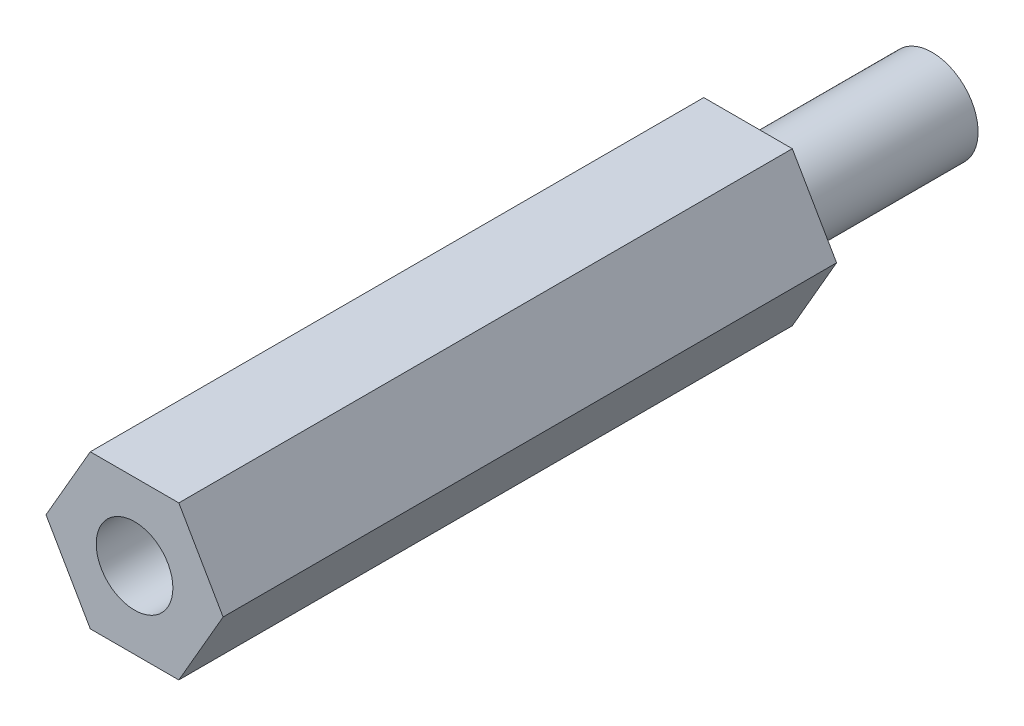
ISO-10303-21;
HEADER;
FILE_DESCRIPTION(('STEP AP214'),'2;1');
FILE_NAME('part.step','',(''),(''),'','','');
FILE_SCHEMA(('AUTOMOTIVE_DESIGN { 1 0 10303 214 1 1 1 1 }'));
ENDSEC;
DATA;
#1=APPLICATION_CONTEXT('core data for automotive mechanical design processes');
#2=APPLICATION_PROTOCOL_DEFINITION('international standard','automotive_design',2000,#1);
#3=PRODUCT_CONTEXT('',#1,'mechanical');
#4=PRODUCT('Part','Part','',(#3));
#5=PRODUCT_RELATED_PRODUCT_CATEGORY('part','',(#4));
#6=PRODUCT_DEFINITION_FORMATION('','',#4);
#7=PRODUCT_DEFINITION_CONTEXT('part definition',#1,'design');
#8=PRODUCT_DEFINITION('design','',#6,#7);
#9=PRODUCT_DEFINITION_SHAPE('','',#8);
#10=(LENGTH_UNIT() NAMED_UNIT(*) SI_UNIT(.MILLI.,.METRE.));
#11=(NAMED_UNIT(*) PLANE_ANGLE_UNIT() SI_UNIT($,.RADIAN.));
#12=(NAMED_UNIT(*) SI_UNIT($,.STERADIAN.) SOLID_ANGLE_UNIT());
#13=UNCERTAINTY_MEASURE_WITH_UNIT(LENGTH_MEASURE(1.E-05),#10,'distance_accuracy_value','');
#14=(GEOMETRIC_REPRESENTATION_CONTEXT(3) GLOBAL_UNCERTAINTY_ASSIGNED_CONTEXT((#13)) GLOBAL_UNIT_ASSIGNED_CONTEXT((#10,
#11,#12)) REPRESENTATION_CONTEXT('',''));
#15=CARTESIAN_POINT('',(0.,0.,0.));
#16=DIRECTION('',(0.,0.,1.));
#17=DIRECTION('',(1.,0.,0.));
#18=AXIS2_PLACEMENT_3D('',#15,#16,#17);
#19=CARTESIAN_POINT('',(1.44337567297406,2.5,20.));
#20=DIRECTION('',(0.,-1.,0.));
#21=DIRECTION('',(1.,0.,0.));
#22=AXIS2_PLACEMENT_3D('',#19,#20,#21);
#23=PLANE('',#22);
#24=DIRECTION('',(-1.,0.,0.));
#25=VECTOR('',#24,1.);
#26=CARTESIAN_POINT('',(1.44337567297406,2.5,0.));
#27=LINE('',#26,#25);
#28=CARTESIAN_POINT('',(1.44337567297406,2.5,0.));
#29=VERTEX_POINT('',#28);
#30=CARTESIAN_POINT('',(-1.44337567297407,2.5,0.));
#31=VERTEX_POINT('',#30);
#32=EDGE_CURVE('E123',#29,#31,#27,.T.);
#33=ORIENTED_EDGE('',*,*,#32,.T.);
#34=DIRECTION('',(0.,0.,-1.));
#35=VECTOR('',#34,1.);
#36=CARTESIAN_POINT('',(-1.44337567297407,2.5,20.));
#37=LINE('',#36,#35);
#38=CARTESIAN_POINT('',(-1.44337567297407,2.5,20.));
#39=VERTEX_POINT('',#38);
#40=EDGE_CURVE('E38',#39,#31,#37,.T.);
#41=ORIENTED_EDGE('',*,*,#40,.F.);
#42=DIRECTION('',(-1.,0.,0.));
#43=VECTOR('',#42,1.);
#44=CARTESIAN_POINT('',(1.44337567297406,2.5,20.));
#45=LINE('',#44,#43);
#46=CARTESIAN_POINT('',(1.44337567297406,2.5,20.));
#47=VERTEX_POINT('',#46);
#48=EDGE_CURVE('E134',#47,#39,#45,.T.);
#49=ORIENTED_EDGE('',*,*,#48,.F.);
#50=DIRECTION('',(0.,0.,-1.));
#51=VECTOR('',#50,1.);
#52=CARTESIAN_POINT('',(1.44337567297406,2.5,20.));
#53=LINE('',#52,#51);
#54=EDGE_CURVE('E119',#47,#29,#53,.T.);
#55=ORIENTED_EDGE('',*,*,#54,.T.);
#56=EDGE_LOOP('',(#33,#41,#49,#55));
#57=FACE_BOUND('',#56,.T.);
#58=ADVANCED_FACE('F35',(#57),#23,.F.);
#59=CARTESIAN_POINT('',(-1.44337567297407,2.5,20.));
#60=DIRECTION('',(0.866025403784439,-0.5,0.));
#61=DIRECTION('',(0.5,0.866025403784439,0.));
#62=AXIS2_PLACEMENT_3D('',#59,#60,#61);
#63=PLANE('',#62);
#64=DIRECTION('',(-0.5,-0.866025403784439,0.));
#65=VECTOR('',#64,1.);
#66=CARTESIAN_POINT('',(-1.44337567297407,2.5,0.));
#67=LINE('',#66,#65);
#68=CARTESIAN_POINT('',(-2.88675134594813,0.,0.));
#69=VERTEX_POINT('',#68);
#70=EDGE_CURVE('E126',#31,#69,#67,.T.);
#71=ORIENTED_EDGE('',*,*,#70,.T.);
#72=DIRECTION('',(0.,0.,-1.));
#73=VECTOR('',#72,1.);
#74=CARTESIAN_POINT('',(-2.88675134594813,0.,20.));
#75=LINE('',#74,#73);
#76=CARTESIAN_POINT('',(-2.88675134594813,0.,20.));
#77=VERTEX_POINT('',#76);
#78=EDGE_CURVE('E137',#77,#69,#75,.T.);
#79=ORIENTED_EDGE('',*,*,#78,.F.);
#80=DIRECTION('',(-0.5,-0.866025403784439,0.));
#81=VECTOR('',#80,1.);
#82=CARTESIAN_POINT('',(-1.44337567297407,2.5,20.));
#83=LINE('',#82,#81);
#84=EDGE_CURVE('E91',#39,#77,#83,.T.);
#85=ORIENTED_EDGE('',*,*,#84,.F.);
#86=ORIENTED_EDGE('',*,*,#40,.T.);
#87=EDGE_LOOP('',(#71,#79,#85,#86));
#88=FACE_BOUND('',#87,.T.);
#89=ADVANCED_FACE('F142',(#88),#63,.F.);
#90=CARTESIAN_POINT('',(-2.88675134594813,0.,20.));
#91=DIRECTION('',(0.866025403784438,0.5,0.));
#92=DIRECTION('',(-0.5,0.866025403784438,0.));
#93=AXIS2_PLACEMENT_3D('',#90,#91,#92);
#94=PLANE('',#93);
#95=DIRECTION('',(0.5,-0.866025403784438,0.));
#96=VECTOR('',#95,1.);
#97=CARTESIAN_POINT('',(-2.88675134594813,0.,0.));
#98=LINE('',#97,#96);
#99=CARTESIAN_POINT('',(-1.44337567297406,-2.5,0.));
#100=VERTEX_POINT('',#99);
#101=EDGE_CURVE('E129',#69,#100,#98,.T.);
#102=ORIENTED_EDGE('',*,*,#101,.T.);
#103=DIRECTION('',(0.,0.,-1.));
#104=VECTOR('',#103,1.);
#105=CARTESIAN_POINT('',(-1.44337567297406,-2.5,20.));
#106=LINE('',#105,#104);
#107=CARTESIAN_POINT('',(-1.44337567297406,-2.5,20.));
#108=VERTEX_POINT('',#107);
#109=EDGE_CURVE('E114',#108,#100,#106,.T.);
#110=ORIENTED_EDGE('',*,*,#109,.F.);
#111=DIRECTION('',(0.5,-0.866025403784438,0.));
#112=VECTOR('',#111,1.);
#113=CARTESIAN_POINT('',(-2.88675134594813,0.,20.));
#114=LINE('',#113,#112);
#115=EDGE_CURVE('E105',#77,#108,#114,.T.);
#116=ORIENTED_EDGE('',*,*,#115,.F.);
#117=ORIENTED_EDGE('',*,*,#78,.T.);
#118=EDGE_LOOP('',(#102,#110,#116,#117));
#119=FACE_BOUND('',#118,.T.);
#120=ADVANCED_FACE('F148',(#119),#94,.F.);
#121=CARTESIAN_POINT('',(-1.44337567297406,-2.5,20.));
#122=DIRECTION('',(0.,1.,0.));
#123=DIRECTION('',(-1.,0.,0.));
#124=AXIS2_PLACEMENT_3D('',#121,#122,#123);
#125=PLANE('',#124);
#126=DIRECTION('',(1.,0.,0.));
#127=VECTOR('',#126,1.);
#128=CARTESIAN_POINT('',(-1.44337567297406,-2.5,0.));
#129=LINE('',#128,#127);
#130=CARTESIAN_POINT('',(1.44337567297407,-2.5,0.));
#131=VERTEX_POINT('',#130);
#132=EDGE_CURVE('E113',#100,#131,#129,.T.);
#133=ORIENTED_EDGE('',*,*,#132,.T.);
#134=DIRECTION('',(0.,0.,-1.));
#135=VECTOR('',#134,1.);
#136=CARTESIAN_POINT('',(1.44337567297407,-2.5,20.));
#137=LINE('',#136,#135);
#138=CARTESIAN_POINT('',(1.44337567297407,-2.5,20.));
#139=VERTEX_POINT('',#138);
#140=EDGE_CURVE('E110',#139,#131,#137,.T.);
#141=ORIENTED_EDGE('',*,*,#140,.F.);
#142=DIRECTION('',(1.,0.,0.));
#143=VECTOR('',#142,1.);
#144=CARTESIAN_POINT('',(-1.44337567297406,-2.5,20.));
#145=LINE('',#144,#143);
#146=EDGE_CURVE('E99',#108,#139,#145,.T.);
#147=ORIENTED_EDGE('',*,*,#146,.F.);
#148=ORIENTED_EDGE('',*,*,#109,.T.);
#149=EDGE_LOOP('',(#133,#141,#147,#148));
#150=FACE_BOUND('',#149,.T.);
#151=ADVANCED_FACE('F111',(#150),#125,.F.);
#152=CARTESIAN_POINT('',(1.44337567297407,-2.5,20.));
#153=DIRECTION('',(-0.866025403784439,0.5,0.));
#154=DIRECTION('',(-0.5,-0.866025403784439,0.));
#155=AXIS2_PLACEMENT_3D('',#152,#153,#154);
#156=PLANE('',#155);
#157=DIRECTION('',(0.5,0.866025403784439,0.));
#158=VECTOR('',#157,1.);
#159=CARTESIAN_POINT('',(1.44337567297407,-2.5,0.));
#160=LINE('',#159,#158);
#161=CARTESIAN_POINT('',(2.88675134594813,0.,0.));
#162=VERTEX_POINT('',#161);
#163=EDGE_CURVE('E76',#131,#162,#160,.T.);
#164=ORIENTED_EDGE('',*,*,#163,.T.);
#165=DIRECTION('',(0.,0.,-1.));
#166=VECTOR('',#165,1.);
#167=CARTESIAN_POINT('',(2.88675134594813,0.,20.));
#168=LINE('',#167,#166);
#169=CARTESIAN_POINT('',(2.88675134594813,0.,20.));
#170=VERTEX_POINT('',#169);
#171=EDGE_CURVE('E115',#170,#162,#168,.T.);
#172=ORIENTED_EDGE('',*,*,#171,.F.);
#173=DIRECTION('',(0.5,0.866025403784439,0.));
#174=VECTOR('',#173,1.);
#175=CARTESIAN_POINT('',(1.44337567297407,-2.5,20.));
#176=LINE('',#175,#174);
#177=EDGE_CURVE('E103',#139,#170,#176,.T.);
#178=ORIENTED_EDGE('',*,*,#177,.F.);
#179=ORIENTED_EDGE('',*,*,#140,.T.);
#180=EDGE_LOOP('',(#164,#172,#178,#179));
#181=FACE_BOUND('',#180,.T.);
#182=ADVANCED_FACE('F117',(#181),#156,.F.);
#183=CARTESIAN_POINT('',(2.88675134594813,0.,20.));
#184=DIRECTION('',(-0.866025403784439,-0.5,0.));
#185=DIRECTION('',(0.5,-0.866025403784439,0.));
#186=AXIS2_PLACEMENT_3D('',#183,#184,#185);
#187=PLANE('',#186);
#188=DIRECTION('',(-0.5,0.866025403784439,0.));
#189=VECTOR('',#188,1.);
#190=CARTESIAN_POINT('',(2.88675134594813,0.,0.));
#191=LINE('',#190,#189);
#192=EDGE_CURVE('E82',#162,#29,#191,.T.);
#193=ORIENTED_EDGE('',*,*,#192,.T.);
#194=ORIENTED_EDGE('',*,*,#54,.F.);
#195=DIRECTION('',(-0.5,0.866025403784439,0.));
#196=VECTOR('',#195,1.);
#197=CARTESIAN_POINT('',(2.88675134594813,0.,20.));
#198=LINE('',#197,#196);
#199=EDGE_CURVE('E52',#170,#47,#198,.T.);
#200=ORIENTED_EDGE('',*,*,#199,.F.);
#201=ORIENTED_EDGE('',*,*,#171,.T.);
#202=EDGE_LOOP('',(#193,#194,#200,#201));
#203=FACE_BOUND('',#202,.T.);
#204=ADVANCED_FACE('F164',(#203),#187,.F.);
#205=CARTESIAN_POINT('',(0.,0.,20.));
#206=DIRECTION('',(0.,0.,1.));
#207=DIRECTION('',(1.,0.,0.));
#208=AXIS2_PLACEMENT_3D('',#205,#206,#207);
#209=PLANE('',#208);
#210=CARTESIAN_POINT('',(0.,0.,20.));
#211=DIRECTION('',(0.,0.,1.));
#212=DIRECTION('',(1.,0.,0.));
#213=AXIS2_PLACEMENT_3D('',#210,#211,#212);
#214=CIRCLE('',#213,1.24999999999999);
#215=CARTESIAN_POINT('',(1.24999999999999,0.,20.));
#216=VERTEX_POINT('',#215);
#217=EDGE_CURVE('E157',#216,#216,#214,.T.);
#218=ORIENTED_EDGE('',*,*,#217,.F.);
#219=EDGE_LOOP('',(#218));
#220=FACE_BOUND('',#219,.T.);
#221=ORIENTED_EDGE('',*,*,#48,.T.);
#222=ORIENTED_EDGE('',*,*,#84,.T.);
#223=ORIENTED_EDGE('',*,*,#115,.T.);
#224=ORIENTED_EDGE('',*,*,#146,.T.);
#225=ORIENTED_EDGE('',*,*,#177,.T.);
#226=ORIENTED_EDGE('',*,*,#199,.T.);
#227=EDGE_LOOP('',(#221,#222,#223,#224,#225,#226));
#228=FACE_BOUND('',#227,.T.);
#229=ADVANCED_FACE('F101',(#220,#228),#209,.T.);
#230=CARTESIAN_POINT('',(0.,0.,0.));
#231=DIRECTION('',(0.,0.,1.));
#232=DIRECTION('',(1.,0.,0.));
#233=AXIS2_PLACEMENT_3D('',#230,#231,#232);
#234=PLANE('',#233);
#235=CARTESIAN_POINT('',(0.,0.,0.));
#236=DIRECTION('',(0.,0.,-1.));
#237=DIRECTION('',(-1.,0.,0.));
#238=AXIS2_PLACEMENT_3D('',#235,#236,#237);
#239=CIRCLE('',#238,1.5);
#240=CARTESIAN_POINT('',(-1.5,0.,0.));
#241=VERTEX_POINT('',#240);
#242=EDGE_CURVE('E11',#241,#241,#239,.T.);
#243=ORIENTED_EDGE('',*,*,#242,.F.);
#244=EDGE_LOOP('',(#243));
#245=FACE_BOUND('',#244,.T.);
#246=ORIENTED_EDGE('',*,*,#32,.F.);
#247=ORIENTED_EDGE('',*,*,#192,.F.);
#248=ORIENTED_EDGE('',*,*,#163,.F.);
#249=ORIENTED_EDGE('',*,*,#132,.F.);
#250=ORIENTED_EDGE('',*,*,#101,.F.);
#251=ORIENTED_EDGE('',*,*,#70,.F.);
#252=EDGE_LOOP('',(#246,#247,#248,#249,#250,#251));
#253=FACE_BOUND('',#252,.T.);
#254=ADVANCED_FACE('F147',(#245,#253),#234,.F.);
#255=CARTESIAN_POINT('',(0.,0.,-6.));
#256=DIRECTION('',(0.,0.,1.));
#257=DIRECTION('',(1.,0.,0.));
#258=AXIS2_PLACEMENT_3D('',#255,#256,#257);
#259=CYLINDRICAL_SURFACE('',#258,1.5);
#260=CARTESIAN_POINT('',(0.,0.,-6.));
#261=DIRECTION('',(0.,0.,-1.));
#262=DIRECTION('',(-1.,0.,0.));
#263=AXIS2_PLACEMENT_3D('',#260,#261,#262);
#264=CIRCLE('',#263,1.5);
#265=CARTESIAN_POINT('',(-1.5,0.,-6.));
#266=VERTEX_POINT('',#265);
#267=EDGE_CURVE('E127',#266,#266,#264,.T.);
#268=ORIENTED_EDGE('',*,*,#267,.F.);
#269=EDGE_LOOP('',(#268));
#270=FACE_BOUND('',#269,.T.);
#271=ORIENTED_EDGE('',*,*,#242,.T.);
#272=EDGE_LOOP('',(#271));
#273=FACE_BOUND('',#272,.T.);
#274=ADVANCED_FACE('F170',(#270,#273),#259,.T.);
#275=CARTESIAN_POINT('',(0.,0.,-6.));
#276=DIRECTION('',(0.,0.,-1.));
#277=DIRECTION('',(-1.,0.,0.));
#278=AXIS2_PLACEMENT_3D('',#275,#276,#277);
#279=PLANE('',#278);
#280=ORIENTED_EDGE('',*,*,#267,.T.);
#281=EDGE_LOOP('',(#280));
#282=FACE_BOUND('',#281,.T.);
#283=ADVANCED_FACE('F211',(#282),#279,.T.);
#284=CARTESIAN_POINT('',(0.,0.,12.5));
#285=DIRECTION('',(0.,0.,1.));
#286=DIRECTION('',(1.,0.,0.));
#287=AXIS2_PLACEMENT_3D('',#284,#285,#286);
#288=CONICAL_SURFACE('',#287,1.25,1.02974425867665);
#289=CARTESIAN_POINT('',(0.,0.,11.7489242262155));
#290=VERTEX_POINT('',#289);
#291=VERTEX_LOOP('',#290);
#292=FACE_BOUND('',#291,.T.);
#293=CARTESIAN_POINT('',(0.,0.,12.5));
#294=DIRECTION('',(0.,0.,1.));
#295=DIRECTION('',(1.,0.,0.));
#296=AXIS2_PLACEMENT_3D('',#293,#294,#295);
#297=CIRCLE('',#296,1.25);
#298=CARTESIAN_POINT('',(1.25,0.,12.5));
#299=VERTEX_POINT('',#298);
#300=EDGE_CURVE('E154',#299,#299,#297,.T.);
#301=ORIENTED_EDGE('',*,*,#300,.T.);
#302=EDGE_LOOP('',(#301));
#303=FACE_BOUND('',#302,.T.);
#304=ADVANCED_FACE('F219',(#292,#303),#288,.F.);
#305=CARTESIAN_POINT('',(0.,0.,20.));
#306=DIRECTION('',(0.,0.,1.));
#307=DIRECTION('',(1.,0.,0.));
#308=AXIS2_PLACEMENT_3D('',#305,#306,#307);
#309=CYLINDRICAL_SURFACE('',#308,1.24999999999999);
#310=ORIENTED_EDGE('',*,*,#300,.F.);
#311=EDGE_LOOP('',(#310));
#312=FACE_BOUND('',#311,.T.);
#313=ORIENTED_EDGE('',*,*,#217,.T.);
#314=EDGE_LOOP('',(#313));
#315=FACE_BOUND('',#314,.T.);
#316=ADVANCED_FACE('F161',(#312,#315),#309,.F.);
#317=CLOSED_SHELL('',(#58,#89,#120,#151,#182,#204,#229,#254,#274,#283,#304,#316));
#318=MANIFOLD_SOLID_BREP('B2',#317);
#319=ADVANCED_BREP_SHAPE_REPRESENTATION('',(#18,#318),#14);
#320=SHAPE_DEFINITION_REPRESENTATION(#9,#319);
ENDSEC;
END-ISO-10303-21;
